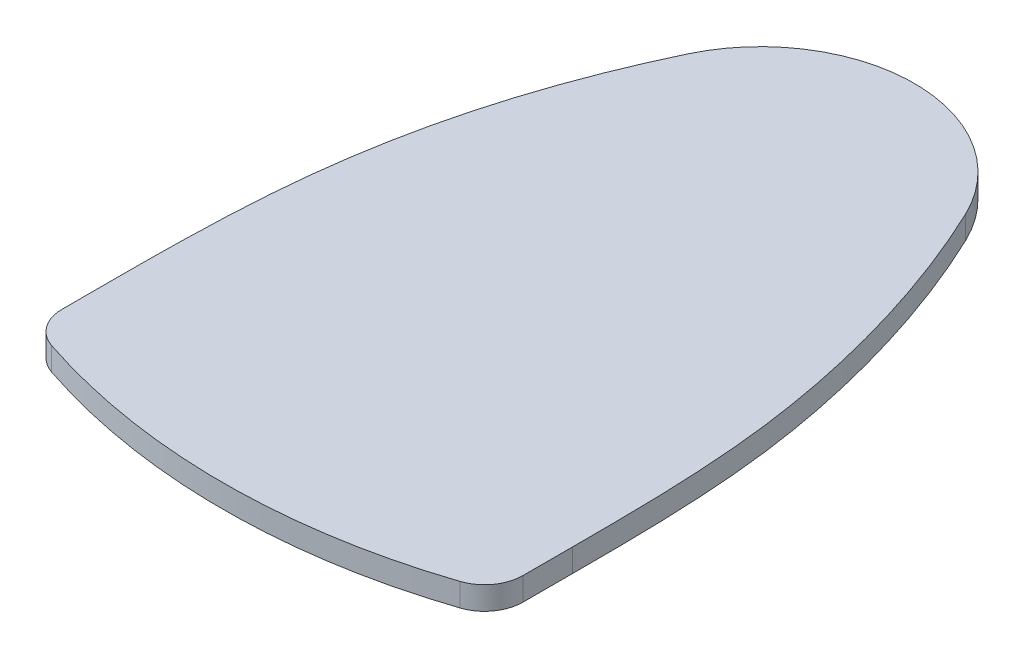
ISO-10303-21;
HEADER;
FILE_DESCRIPTION(('STEP AP214'),'2;1');
FILE_NAME('part.step','',(''),(''),'','','');
FILE_SCHEMA(('AUTOMOTIVE_DESIGN { 1 0 10303 214 1 1 1 1 }'));
ENDSEC;
DATA;
#1=APPLICATION_CONTEXT('core data for automotive mechanical design processes');
#2=APPLICATION_PROTOCOL_DEFINITION('international standard','automotive_design',2000,#1);
#3=PRODUCT_CONTEXT('',#1,'mechanical');
#4=PRODUCT('Part','Part','',(#3));
#5=PRODUCT_RELATED_PRODUCT_CATEGORY('part','',(#4));
#6=PRODUCT_DEFINITION_FORMATION('','',#4);
#7=PRODUCT_DEFINITION_CONTEXT('part definition',#1,'design');
#8=PRODUCT_DEFINITION('design','',#6,#7);
#9=PRODUCT_DEFINITION_SHAPE('','',#8);
#10=(LENGTH_UNIT() NAMED_UNIT(*) SI_UNIT(.MILLI.,.METRE.));
#11=(NAMED_UNIT(*) PLANE_ANGLE_UNIT() SI_UNIT($,.RADIAN.));
#12=(NAMED_UNIT(*) SI_UNIT($,.STERADIAN.) SOLID_ANGLE_UNIT());
#13=UNCERTAINTY_MEASURE_WITH_UNIT(LENGTH_MEASURE(1.E-05),#10,'distance_accuracy_value','');
#14=(GEOMETRIC_REPRESENTATION_CONTEXT(3) GLOBAL_UNCERTAINTY_ASSIGNED_CONTEXT((#13)) GLOBAL_UNIT_ASSIGNED_CONTEXT((#10,
#11,#12)) REPRESENTATION_CONTEXT('',''));
#15=CARTESIAN_POINT('',(0.,0.,0.));
#16=DIRECTION('',(0.,0.,1.));
#17=DIRECTION('',(1.,0.,0.));
#18=AXIS2_PLACEMENT_3D('',#15,#16,#17);
#19=CARTESIAN_POINT('',(18.0594798138338,3.,-8.59390416828862));
#20=CARTESIAN_POINT('',(23.4237828542928,3.,2.67879803752952));
#21=CARTESIAN_POINT('',(29.8650564961862,3.,24.4321849656559));
#22=CARTESIAN_POINT('',(30.,3.,46.2917449629831));
#23=CARTESIAN_POINT('',(30.,3.,54.4601809837321));
#24=B_SPLINE_CURVE_WITH_KNOTS('',3,(#19,#20,#21,#22,#23),.UNSPECIFIED.,.F.,.F.,(4,1,4),(0.,
0.608662133711793,1.),.UNSPECIFIED.);
#25=DIRECTION('',(0.,-1.,0.));
#26=VECTOR('',#25,1.);
#27=SURFACE_OF_LINEAR_EXTRUSION('',#24,#26);
#28=CARTESIAN_POINT('',(18.0594798138338,0.,-8.59390416828862));
#29=CARTESIAN_POINT('',(23.4237828542928,0.,2.67879803752952));
#30=CARTESIAN_POINT('',(29.8650564961862,0.,24.4321849656559));
#31=CARTESIAN_POINT('',(30.,0.,46.2917449629831));
#32=CARTESIAN_POINT('',(30.,0.,54.4601809837321));
#33=B_SPLINE_CURVE_WITH_KNOTS('',3,(#28,#29,#30,#31,#32),.UNSPECIFIED.,.F.,.F.,(4,1,4),(0.,
0.608662133711793,1.),.UNSPECIFIED.);
#34=CARTESIAN_POINT('',(18.0594798138338,0.,-8.59390416828862));
#35=VERTEX_POINT('',#34);
#36=CARTESIAN_POINT('',(30.,0.,54.4601809837321));
#37=VERTEX_POINT('',#36);
#38=EDGE_CURVE('E112',#35,#37,#33,.T.);
#39=ORIENTED_EDGE('',*,*,#38,.F.);
#40=DIRECTION('',(0.,-1.,0.));
#41=VECTOR('',#40,1.);
#42=CARTESIAN_POINT('',(18.0594798138338,3.,-8.59390416828862));
#43=LINE('',#42,#41);
#44=CARTESIAN_POINT('',(18.0594798138338,3.,-8.59390416828862));
#45=VERTEX_POINT('',#44);
#46=EDGE_CURVE('E107',#45,#35,#43,.T.);
#47=ORIENTED_EDGE('',*,*,#46,.F.);
#48=CARTESIAN_POINT('',(30.,3.,54.4601809837321));
#49=VERTEX_POINT('',#48);
#50=EDGE_CURVE('E110',#45,#49,#24,.T.);
#51=ORIENTED_EDGE('',*,*,#50,.T.);
#52=DIRECTION('',(0.,-1.,0.));
#53=VECTOR('',#52,1.);
#54=CARTESIAN_POINT('',(30.,3.,54.4601809837321));
#55=LINE('',#54,#53);
#56=EDGE_CURVE('E172',#49,#37,#55,.T.);
#57=ORIENTED_EDGE('',*,*,#56,.T.);
#58=EDGE_LOOP('',(#39,#47,#51,#57));
#59=FACE_BOUND('',#58,.T.);
#60=ADVANCED_FACE('F38',(#59),#27,.T.);
#61=CARTESIAN_POINT('',(0.,3.,0.));
#62=DIRECTION('',(0.,-1.,0.));
#63=DIRECTION('',(0.,0.,-1.));
#64=AXIS2_PLACEMENT_3D('',#61,#62,#63);
#65=CYLINDRICAL_SURFACE('',#64,20.);
#66=CARTESIAN_POINT('',(0.,0.,0.));
#67=DIRECTION('',(0.,1.,0.));
#68=DIRECTION('',(0.,0.,1.));
#69=AXIS2_PLACEMENT_3D('',#66,#67,#68);
#70=CIRCLE('',#69,20.);
#71=CARTESIAN_POINT('',(-18.0594798138338,0.,-8.59390416828862));
#72=VERTEX_POINT('',#71);
#73=EDGE_CURVE('E182',#35,#72,#70,.T.);
#74=ORIENTED_EDGE('',*,*,#73,.T.);
#75=DIRECTION('',(0.,-1.,0.));
#76=VECTOR('',#75,1.);
#77=CARTESIAN_POINT('',(-18.0594798138338,3.,-8.59390416828862));
#78=LINE('',#77,#76);
#79=CARTESIAN_POINT('',(-18.0594798138338,3.,-8.59390416828862));
#80=VERTEX_POINT('',#79);
#81=EDGE_CURVE('E116',#80,#72,#78,.T.);
#82=ORIENTED_EDGE('',*,*,#81,.F.);
#83=CARTESIAN_POINT('',(0.,3.,0.));
#84=DIRECTION('',(0.,1.,0.));
#85=DIRECTION('',(0.,0.,1.));
#86=AXIS2_PLACEMENT_3D('',#83,#84,#85);
#87=CIRCLE('',#86,20.);
#88=EDGE_CURVE('E119',#45,#80,#87,.T.);
#89=ORIENTED_EDGE('',*,*,#88,.F.);
#90=ORIENTED_EDGE('',*,*,#46,.T.);
#91=EDGE_LOOP('',(#74,#82,#89,#90));
#92=FACE_BOUND('',#91,.T.);
#93=ADVANCED_FACE('F120',(#92),#65,.T.);
#94=CARTESIAN_POINT('',(-18.0594798138338,3.,-8.59390416828862));
#95=CARTESIAN_POINT('',(-23.9481932561399,3.,3.78080928653413));
#96=CARTESIAN_POINT('',(-29.6964722880092,3.,24.3412639201111));
#97=CARTESIAN_POINT('',(-30.,3.,45.9531086910274));
#98=CARTESIAN_POINT('',(-30.,3.,54.4601809837321));
#99=B_SPLINE_CURVE_WITH_KNOTS('',3,(#94,#95,#96,#97,#98),.UNSPECIFIED.,.F.,.F.,(4,1,4),(0.,
0.608662133711793,1.),.UNSPECIFIED.);
#100=DIRECTION('',(0.,-1.,0.));
#101=VECTOR('',#100,1.);
#102=SURFACE_OF_LINEAR_EXTRUSION('',#99,#101);
#103=CARTESIAN_POINT('',(-18.0594798138338,0.,-8.59390416828862));
#104=CARTESIAN_POINT('',(-23.9481932561399,0.,3.78080928653413));
#105=CARTESIAN_POINT('',(-29.6964722880092,0.,24.3412639201111));
#106=CARTESIAN_POINT('',(-30.,0.,45.9531086910274));
#107=CARTESIAN_POINT('',(-30.,0.,54.4601809837321));
#108=B_SPLINE_CURVE_WITH_KNOTS('',3,(#103,#104,#105,#106,#107),.UNSPECIFIED.,.F.,.F.,(4,1,4),
(0.,0.608662133711793,1.),.UNSPECIFIED.);
#109=CARTESIAN_POINT('',(-30.,0.,54.4601809837321));
#110=VERTEX_POINT('',#109);
#111=EDGE_CURVE('E178',#72,#110,#108,.T.);
#112=ORIENTED_EDGE('',*,*,#111,.T.);
#113=DIRECTION('',(0.,-1.,0.));
#114=VECTOR('',#113,1.);
#115=CARTESIAN_POINT('',(-30.,3.,54.4601809837321));
#116=LINE('',#115,#114);
#117=CARTESIAN_POINT('',(-30.,3.,54.4601809837321));
#118=VERTEX_POINT('',#117);
#119=EDGE_CURVE('E169',#118,#110,#116,.T.);
#120=ORIENTED_EDGE('',*,*,#119,.F.);
#121=EDGE_CURVE('E123',#80,#118,#99,.T.);
#122=ORIENTED_EDGE('',*,*,#121,.F.);
#123=ORIENTED_EDGE('',*,*,#81,.T.);
#124=EDGE_LOOP('',(#112,#120,#122,#123));
#125=FACE_BOUND('',#124,.T.);
#126=ADVANCED_FACE('F203',(#125),#102,.F.);
#127=CARTESIAN_POINT('',(-30.,3.,0.));
#128=DIRECTION('',(1.,0.,0.));
#129=DIRECTION('',(0.,0.,-1.));
#130=AXIS2_PLACEMENT_3D('',#127,#128,#129);
#131=PLANE('',#130);
#132=DIRECTION('',(0.,0.,1.));
#133=VECTOR('',#132,1.);
#134=CARTESIAN_POINT('',(-30.,0.,0.));
#135=LINE('',#134,#133);
#136=CARTESIAN_POINT('',(-30.,0.,60.9399759807808));
#137=VERTEX_POINT('',#136);
#138=EDGE_CURVE('E176',#110,#137,#135,.T.);
#139=ORIENTED_EDGE('',*,*,#138,.T.);
#140=DIRECTION('',(0.,-1.,0.));
#141=VECTOR('',#140,1.);
#142=CARTESIAN_POINT('',(-30.,3.,60.9399759807808));
#143=LINE('',#142,#141);
#144=CARTESIAN_POINT('',(-30.,3.,60.9399759807808));
#145=VERTEX_POINT('',#144);
#146=EDGE_CURVE('E61',#137,#145,#143,.F.);
#147=ORIENTED_EDGE('',*,*,#146,.T.);
#148=DIRECTION('',(0.,0.,1.));
#149=VECTOR('',#148,1.);
#150=CARTESIAN_POINT('',(-30.,3.,0.));
#151=LINE('',#150,#149);
#152=EDGE_CURVE('E196',#118,#145,#151,.T.);
#153=ORIENTED_EDGE('',*,*,#152,.F.);
#154=ORIENTED_EDGE('',*,*,#119,.T.);
#155=EDGE_LOOP('',(#139,#147,#153,#154));
#156=FACE_BOUND('',#155,.T.);
#157=ADVANCED_FACE('F206',(#156),#131,.F.);
#158=CARTESIAN_POINT('',(0.,3.,-14.));
#159=DIRECTION('',(0.,-1.,0.));
#160=DIRECTION('',(0.,0.,-1.));
#161=AXIS2_PLACEMENT_3D('',#158,#159,#160);
#162=CYLINDRICAL_SURFACE('',#161,84.);
#163=CARTESIAN_POINT('',(0.,3.,-14.));
#164=DIRECTION('',(0.,1.,0.));
#165=DIRECTION('',(0.,0.,1.));
#166=AXIS2_PLACEMENT_3D('',#163,#164,#165);
#167=CIRCLE('',#166,84.);
#168=CARTESIAN_POINT('',(-26.5822784810127,3.,65.6830124352606));
#169=VERTEX_POINT('',#168);
#170=CARTESIAN_POINT('',(26.5822784810126,3.,65.6830124352606));
#171=VERTEX_POINT('',#170);
#172=EDGE_CURVE('E194',#169,#171,#167,.T.);
#173=ORIENTED_EDGE('',*,*,#172,.F.);
#174=DIRECTION('',(0.,-1.,0.));
#175=VECTOR('',#174,1.);
#176=CARTESIAN_POINT('',(-26.5822784810127,3.,65.6830124352606));
#177=LINE('',#176,#175);
#178=CARTESIAN_POINT('',(-26.5822784810127,0.,65.6830124352606));
#179=VERTEX_POINT('',#178);
#180=EDGE_CURVE('E157',#169,#179,#177,.T.);
#181=ORIENTED_EDGE('',*,*,#180,.T.);
#182=CARTESIAN_POINT('',(0.,0.,-14.));
#183=DIRECTION('',(0.,1.,0.));
#184=DIRECTION('',(0.,0.,1.));
#185=AXIS2_PLACEMENT_3D('',#182,#183,#184);
#186=CIRCLE('',#185,84.);
#187=CARTESIAN_POINT('',(26.5822784810126,0.,65.6830124352606));
#188=VERTEX_POINT('',#187);
#189=EDGE_CURVE('E130',#179,#188,#186,.T.);
#190=ORIENTED_EDGE('',*,*,#189,.T.);
#191=DIRECTION('',(0.,-1.,0.));
#192=VECTOR('',#191,1.);
#193=CARTESIAN_POINT('',(26.5822784810126,3.,65.6830124352606));
#194=LINE('',#193,#192);
#195=EDGE_CURVE('E115',#188,#171,#194,.F.);
#196=ORIENTED_EDGE('',*,*,#195,.T.);
#197=EDGE_LOOP('',(#173,#181,#190,#196));
#198=FACE_BOUND('',#197,.T.);
#199=ADVANCED_FACE('F210',(#198),#162,.T.);
#200=CARTESIAN_POINT('',(30.,3.,0.));
#201=DIRECTION('',(1.,0.,0.));
#202=DIRECTION('',(0.,0.,-1.));
#203=AXIS2_PLACEMENT_3D('',#200,#201,#202);
#204=PLANE('',#203);
#205=DIRECTION('',(0.,0.,1.));
#206=VECTOR('',#205,1.);
#207=CARTESIAN_POINT('',(30.,3.,0.));
#208=LINE('',#207,#206);
#209=CARTESIAN_POINT('',(30.,3.,60.9399759807808));
#210=VERTEX_POINT('',#209);
#211=EDGE_CURVE('E126',#49,#210,#208,.T.);
#212=ORIENTED_EDGE('',*,*,#211,.T.);
#213=DIRECTION('',(0.,1.,0.));
#214=VECTOR('',#213,1.);
#215=CARTESIAN_POINT('',(30.,0.,60.9399759807808));
#216=LINE('',#215,#214);
#217=CARTESIAN_POINT('',(30.,0.,60.9399759807808));
#218=VERTEX_POINT('',#217);
#219=EDGE_CURVE('E11',#210,#218,#216,.F.);
#220=ORIENTED_EDGE('',*,*,#219,.T.);
#221=DIRECTION('',(0.,0.,1.));
#222=VECTOR('',#221,1.);
#223=CARTESIAN_POINT('',(30.,0.,0.));
#224=LINE('',#223,#222);
#225=EDGE_CURVE('E127',#37,#218,#224,.T.);
#226=ORIENTED_EDGE('',*,*,#225,.F.);
#227=ORIENTED_EDGE('',*,*,#56,.F.);
#228=EDGE_LOOP('',(#212,#220,#226,#227));
#229=FACE_BOUND('',#228,.T.);
#230=ADVANCED_FACE('F213',(#229),#204,.T.);
#231=CARTESIAN_POINT('',(0.,3.,0.));
#232=DIRECTION('',(0.,1.,0.));
#233=DIRECTION('',(0.,0.,1.));
#234=AXIS2_PLACEMENT_3D('',#231,#232,#233);
#235=PLANE('',#234);
#236=ORIENTED_EDGE('',*,*,#152,.T.);
#237=CARTESIAN_POINT('',(-25.,3.,60.9399759807808));
#238=DIRECTION('',(0.,1.,0.));
#239=DIRECTION('',(0.,0.,1.));
#240=AXIS2_PLACEMENT_3D('',#237,#238,#239);
#241=CIRCLE('',#240,5.);
#242=EDGE_CURVE('E46',#145,#169,#241,.T.);
#243=ORIENTED_EDGE('',*,*,#242,.T.);
#244=ORIENTED_EDGE('',*,*,#172,.T.);
#245=CARTESIAN_POINT('',(25.,3.,60.9399759807808));
#246=DIRECTION('',(0.,1.,0.));
#247=DIRECTION('',(0.,0.,1.));
#248=AXIS2_PLACEMENT_3D('',#245,#246,#247);
#249=CIRCLE('',#248,5.);
#250=EDGE_CURVE('E53',#171,#210,#249,.T.);
#251=ORIENTED_EDGE('',*,*,#250,.T.);
#252=ORIENTED_EDGE('',*,*,#211,.F.);
#253=ORIENTED_EDGE('',*,*,#50,.F.);
#254=ORIENTED_EDGE('',*,*,#88,.T.);
#255=ORIENTED_EDGE('',*,*,#121,.T.);
#256=EDGE_LOOP('',(#236,#243,#244,#251,#252,#253,#254,#255));
#257=FACE_BOUND('',#256,.T.);
#258=ADVANCED_FACE('F125',(#257),#235,.T.);
#259=CARTESIAN_POINT('',(0.,0.,0.));
#260=DIRECTION('',(0.,1.,0.));
#261=DIRECTION('',(0.,0.,1.));
#262=AXIS2_PLACEMENT_3D('',#259,#260,#261);
#263=PLANE('',#262);
#264=ORIENTED_EDGE('',*,*,#189,.F.);
#265=CARTESIAN_POINT('',(-25.,0.,60.9399759807808));
#266=DIRECTION('',(0.,1.,0.));
#267=DIRECTION('',(0.,0.,1.));
#268=AXIS2_PLACEMENT_3D('',#265,#266,#267);
#269=CIRCLE('',#268,5.);
#270=EDGE_CURVE('E162',#179,#137,#269,.F.);
#271=ORIENTED_EDGE('',*,*,#270,.T.);
#272=ORIENTED_EDGE('',*,*,#138,.F.);
#273=ORIENTED_EDGE('',*,*,#111,.F.);
#274=ORIENTED_EDGE('',*,*,#73,.F.);
#275=ORIENTED_EDGE('',*,*,#38,.T.);
#276=ORIENTED_EDGE('',*,*,#225,.T.);
#277=CARTESIAN_POINT('',(25.,0.,60.9399759807808));
#278=DIRECTION('',(0.,1.,0.));
#279=DIRECTION('',(0.,0.,1.));
#280=AXIS2_PLACEMENT_3D('',#277,#278,#279);
#281=CIRCLE('',#280,5.);
#282=EDGE_CURVE('E164',#218,#188,#281,.F.);
#283=ORIENTED_EDGE('',*,*,#282,.T.);
#284=EDGE_LOOP('',(#264,#271,#272,#273,#274,#275,#276,#283));
#285=FACE_BOUND('',#284,.T.);
#286=ADVANCED_FACE('F145',(#285),#263,.F.);
#287=CARTESIAN_POINT('',(-25.,3.,60.9399759807808));
#288=DIRECTION('',(0.,-1.,0.));
#289=DIRECTION('',(0.,0.,-1.));
#290=AXIS2_PLACEMENT_3D('',#287,#288,#289);
#291=CYLINDRICAL_SURFACE('',#290,5.);
#292=ORIENTED_EDGE('',*,*,#242,.F.);
#293=ORIENTED_EDGE('',*,*,#146,.F.);
#294=ORIENTED_EDGE('',*,*,#270,.F.);
#295=ORIENTED_EDGE('',*,*,#180,.F.);
#296=EDGE_LOOP('',(#292,#293,#294,#295));
#297=FACE_BOUND('',#296,.T.);
#298=ADVANCED_FACE('F143',(#297),#291,.T.);
#299=CARTESIAN_POINT('',(25.,3.,60.9399759807808));
#300=DIRECTION('',(0.,-1.,0.));
#301=DIRECTION('',(0.,0.,-1.));
#302=AXIS2_PLACEMENT_3D('',#299,#300,#301);
#303=CYLINDRICAL_SURFACE('',#302,5.);
#304=ORIENTED_EDGE('',*,*,#250,.F.);
#305=ORIENTED_EDGE('',*,*,#195,.F.);
#306=ORIENTED_EDGE('',*,*,#282,.F.);
#307=ORIENTED_EDGE('',*,*,#219,.F.);
#308=EDGE_LOOP('',(#304,#305,#306,#307));
#309=FACE_BOUND('',#308,.T.);
#310=ADVANCED_FACE('F40',(#309),#303,.T.);
#311=CLOSED_SHELL('',(#60,#93,#126,#157,#199,#230,#258,#286,#298,#310));
#312=MANIFOLD_SOLID_BREP('B2',#311);
#313=ADVANCED_BREP_SHAPE_REPRESENTATION('',(#18,#312),#14);
#314=SHAPE_DEFINITION_REPRESENTATION(#9,#313);
ENDSEC;
END-ISO-10303-21;
